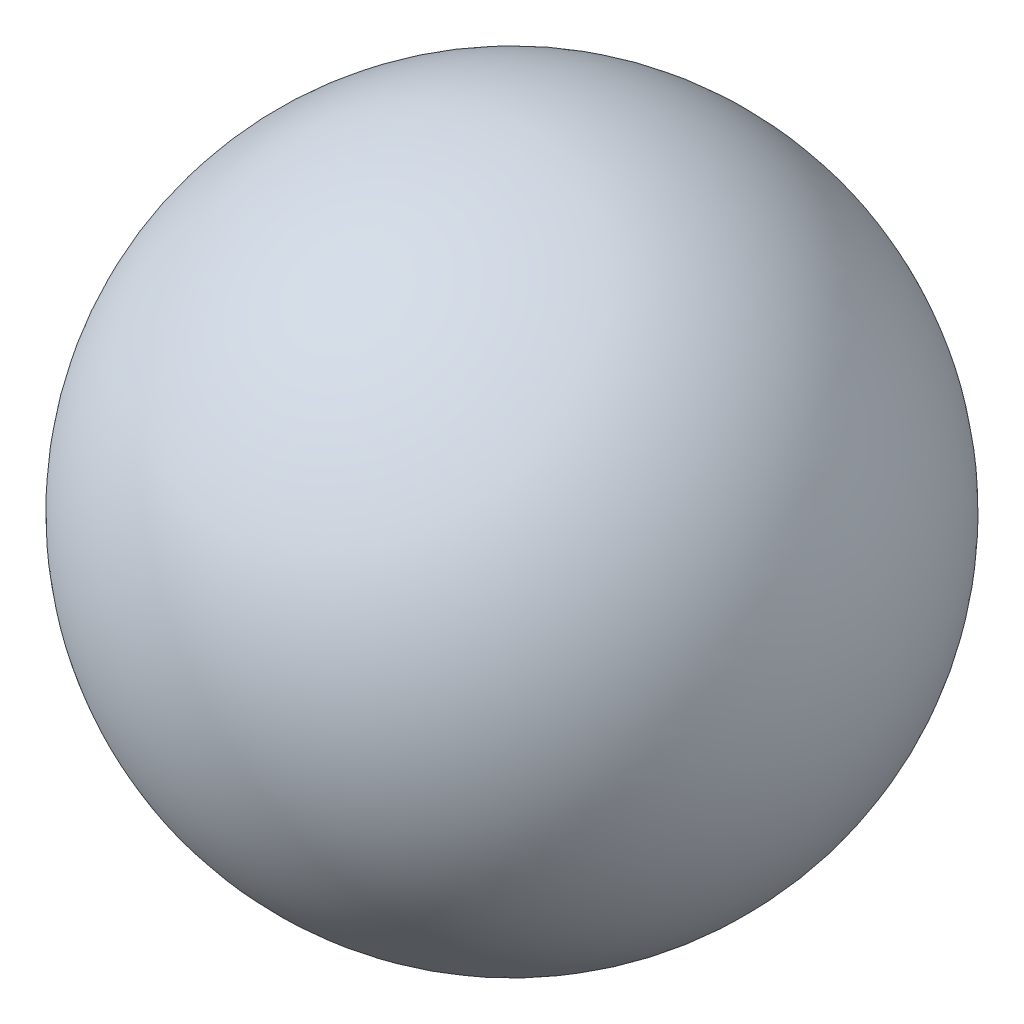
ISO-10303-21;
HEADER;
FILE_DESCRIPTION(('STEP AP214'),'2;1');
FILE_NAME('part.step','',(''),(''),'','','');
FILE_SCHEMA(('AUTOMOTIVE_DESIGN { 1 0 10303 214 1 1 1 1 }'));
ENDSEC;
DATA;
#1=APPLICATION_CONTEXT('core data for automotive mechanical design processes');
#2=APPLICATION_PROTOCOL_DEFINITION('international standard','automotive_design',2000,#1);
#3=PRODUCT_CONTEXT('',#1,'mechanical');
#4=PRODUCT('Part','Part','',(#3));
#5=PRODUCT_RELATED_PRODUCT_CATEGORY('part','',(#4));
#6=PRODUCT_DEFINITION_FORMATION('','',#4);
#7=PRODUCT_DEFINITION_CONTEXT('part definition',#1,'design');
#8=PRODUCT_DEFINITION('design','',#6,#7);
#9=PRODUCT_DEFINITION_SHAPE('','',#8);
#10=(LENGTH_UNIT() NAMED_UNIT(*) SI_UNIT(.MILLI.,.METRE.));
#11=(NAMED_UNIT(*) PLANE_ANGLE_UNIT() SI_UNIT($,.RADIAN.));
#12=(NAMED_UNIT(*) SI_UNIT($,.STERADIAN.) SOLID_ANGLE_UNIT());
#13=UNCERTAINTY_MEASURE_WITH_UNIT(LENGTH_MEASURE(1.E-05),#10,'distance_accuracy_value','');
#14=(GEOMETRIC_REPRESENTATION_CONTEXT(3) GLOBAL_UNCERTAINTY_ASSIGNED_CONTEXT((#13)) GLOBAL_UNIT_ASSIGNED_CONTEXT((#10,
#11,#12)) REPRESENTATION_CONTEXT('',''));
#15=CARTESIAN_POINT('',(0.,0.,0.));
#16=DIRECTION('',(0.,0.,1.));
#17=DIRECTION('',(1.,0.,0.));
#18=AXIS2_PLACEMENT_3D('',#15,#16,#17);
#19=CARTESIAN_POINT('',(0.,0.,0.));
#20=DIRECTION('',(0.,0.,1.));
#21=DIRECTION('',(0.,1.,0.));
#22=AXIS2_PLACEMENT_3D('',#19,#20,#21);
#23=SPHERICAL_SURFACE('',#22,274.955);
#24=CARTESIAN_POINT('',(0.,0.,274.955));
#25=VERTEX_POINT('',#24);
#26=VERTEX_LOOP('',#25);
#27=FACE_BOUND('',#26,.T.);
#28=ADVANCED_FACE('F37',(#27),#23,.T.);
#29=CLOSED_SHELL('',(#28));
#30=CARTESIAN_POINT('',(0.,0.,0.));
#31=DIRECTION('',(0.,0.,1.));
#32=DIRECTION('',(0.,1.,0.));
#33=AXIS2_PLACEMENT_3D('',#30,#31,#32);
#34=SPHERICAL_SURFACE('',#33,272.415);
#35=CARTESIAN_POINT('',(0.,0.,272.415));
#36=VERTEX_POINT('',#35);
#37=VERTEX_LOOP('',#36);
#38=FACE_BOUND('',#37,.T.);
#39=ADVANCED_FACE('F39',(#38),#34,.F.);
#40=CLOSED_SHELL('',(#39));
#41=ORIENTED_CLOSED_SHELL('',*,#40,.T.);
#42=BREP_WITH_VOIDS('B2',#29,(#41));
#43=ADVANCED_BREP_SHAPE_REPRESENTATION('',(#18,#42),#14);
#44=SHAPE_DEFINITION_REPRESENTATION(#9,#43);
ENDSEC;
END-ISO-10303-21;
